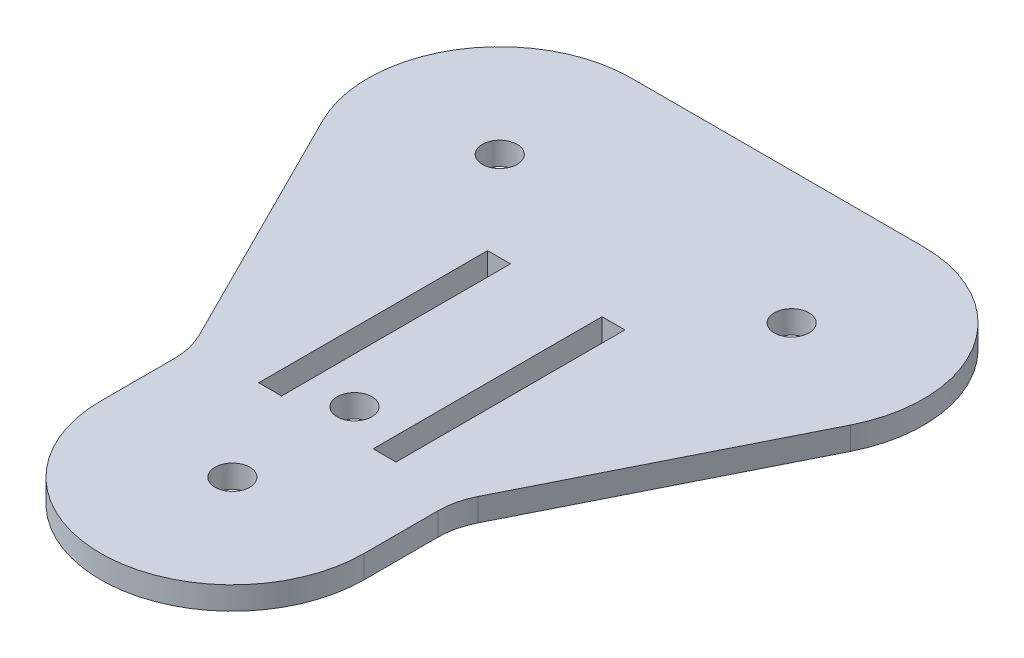
ISO-10303-21;
HEADER;
FILE_DESCRIPTION(('STEP AP214'),'2;1');
FILE_NAME('part.step','',(''),(''),'','','');
FILE_SCHEMA(('AUTOMOTIVE_DESIGN { 1 0 10303 214 1 1 1 1 }'));
ENDSEC;
DATA;
#1=APPLICATION_CONTEXT('core data for automotive mechanical design processes');
#2=APPLICATION_PROTOCOL_DEFINITION('international standard','automotive_design',2000,#1);
#3=PRODUCT_CONTEXT('',#1,'mechanical');
#4=PRODUCT('Part','Part','',(#3));
#5=PRODUCT_RELATED_PRODUCT_CATEGORY('part','',(#4));
#6=PRODUCT_DEFINITION_FORMATION('','',#4);
#7=PRODUCT_DEFINITION_CONTEXT('part definition',#1,'design');
#8=PRODUCT_DEFINITION('design','',#6,#7);
#9=PRODUCT_DEFINITION_SHAPE('','',#8);
#10=(LENGTH_UNIT() NAMED_UNIT(*) SI_UNIT(.MILLI.,.METRE.));
#11=(NAMED_UNIT(*) PLANE_ANGLE_UNIT() SI_UNIT($,.RADIAN.));
#12=(NAMED_UNIT(*) SI_UNIT($,.STERADIAN.) SOLID_ANGLE_UNIT());
#13=UNCERTAINTY_MEASURE_WITH_UNIT(LENGTH_MEASURE(1.E-05),#10,'distance_accuracy_value','');
#14=(GEOMETRIC_REPRESENTATION_CONTEXT(3) GLOBAL_UNCERTAINTY_ASSIGNED_CONTEXT((#13)) GLOBAL_UNIT_ASSIGNED_CONTEXT((#10,
#11,#12)) REPRESENTATION_CONTEXT('',''));
#15=CARTESIAN_POINT('',(0.,0.,0.));
#16=DIRECTION('',(0.,0.,1.));
#17=DIRECTION('',(1.,0.,0.));
#18=AXIS2_PLACEMENT_3D('',#15,#16,#17);
#19=CARTESIAN_POINT('',(0.,3.175,0.));
#20=DIRECTION('',(0.,1.,0.));
#21=DIRECTION('',(0.,0.,1.));
#22=AXIS2_PLACEMENT_3D('',#19,#20,#21);
#23=PLANE('',#22);
#24=DIRECTION('',(0.,0.,1.));
#25=VECTOR('',#24,1.);
#26=CARTESIAN_POINT('',(18.288,3.175,0.));
#27=LINE('',#26,#25);
#28=CARTESIAN_POINT('',(18.288,3.175,6.69138381866599));
#29=VERTEX_POINT('',#28);
#30=CARTESIAN_POINT('',(18.288,3.175,16.9333333333333));
#31=VERTEX_POINT('',#30);
#32=EDGE_CURVE('E256',#29,#31,#27,.T.);
#33=ORIENTED_EDGE('',*,*,#32,.F.);
#34=CARTESIAN_POINT('',(28.288,3.175,6.69138381866599));
#35=DIRECTION('',(0.,1.,0.));
#36=DIRECTION('',(0.,0.,1.));
#37=AXIS2_PLACEMENT_3D('',#34,#35,#36);
#38=CIRCLE('',#37,10.);
#39=CARTESIAN_POINT('',(19.3477723666203,3.175,2.21116843730827));
#40=VERTEX_POINT('',#39);
#41=EDGE_CURVE('E381',#29,#40,#38,.F.);
#42=ORIENTED_EDGE('',*,*,#41,.T.);
#43=DIRECTION('',(0.448021538135772,0.,-0.894022763337969));
#44=VECTOR('',#43,1.);
#45=CARTESIAN_POINT('',(16.3498882959248,3.175,8.19341788942701));
#46=LINE('',#45,#44);
#47=CARTESIAN_POINT('',(36.5936882959248,3.175,-32.202894510573));
#48=VERTEX_POINT('',#47);
#49=EDGE_CURVE('E259',#40,#48,#46,.T.);
#50=ORIENTED_EDGE('',*,*,#49,.T.);
#51=CARTESIAN_POINT('',(20.2438,3.175,-40.3963124));
#52=DIRECTION('',(0.,1.,0.));
#53=DIRECTION('',(0.,0.,1.));
#54=AXIS2_PLACEMENT_3D('',#51,#52,#53);
#55=CIRCLE('',#54,18.288);
#56=CARTESIAN_POINT('',(20.2438,3.175,-58.6843124));
#57=VERTEX_POINT('',#56);
#58=EDGE_CURVE('E263',#48,#57,#55,.T.);
#59=ORIENTED_EDGE('',*,*,#58,.T.);
#60=DIRECTION('',(1.,0.,0.));
#61=VECTOR('',#60,1.);
#62=CARTESIAN_POINT('',(0.,3.175,-58.6843124));
#63=LINE('',#62,#61);
#64=CARTESIAN_POINT('',(-20.2438,3.175,-58.6843124));
#65=VERTEX_POINT('',#64);
#66=EDGE_CURVE('E266',#65,#57,#63,.T.);
#67=ORIENTED_EDGE('',*,*,#66,.F.);
#68=CARTESIAN_POINT('',(-20.2438,3.175,-40.3963124));
#69=DIRECTION('',(0.,1.,0.));
#70=DIRECTION('',(0.,0.,1.));
#71=AXIS2_PLACEMENT_3D('',#68,#69,#70);
#72=CIRCLE('',#71,18.288);
#73=CARTESIAN_POINT('',(-36.5936882959248,3.175,-32.202894510573));
#74=VERTEX_POINT('',#73);
#75=EDGE_CURVE('E270',#65,#74,#72,.T.);
#76=ORIENTED_EDGE('',*,*,#75,.T.);
#77=DIRECTION('',(0.448021538135772,0.,0.894022763337969));
#78=VECTOR('',#77,1.);
#79=CARTESIAN_POINT('',(-16.3498882959248,3.175,8.193417889427));
#80=LINE('',#79,#78);
#81=CARTESIAN_POINT('',(-19.3477723666203,3.175,2.21116843730828));
#82=VERTEX_POINT('',#81);
#83=EDGE_CURVE('E273',#74,#82,#80,.T.);
#84=ORIENTED_EDGE('',*,*,#83,.T.);
#85=CARTESIAN_POINT('',(-28.288,3.175,6.69138381866599));
#86=DIRECTION('',(0.,1.,0.));
#87=DIRECTION('',(0.,0.,1.));
#88=AXIS2_PLACEMENT_3D('',#85,#86,#87);
#89=CIRCLE('',#88,10.);
#90=CARTESIAN_POINT('',(-18.288,3.175,6.69138381866599));
#91=VERTEX_POINT('',#90);
#92=EDGE_CURVE('E11',#82,#91,#89,.F.);
#93=ORIENTED_EDGE('',*,*,#92,.T.);
#94=DIRECTION('',(0.,0.,1.));
#95=VECTOR('',#94,1.);
#96=CARTESIAN_POINT('',(-18.288,3.175,0.));
#97=LINE('',#96,#95);
#98=CARTESIAN_POINT('',(-18.288,3.175,16.9333333333333));
#99=VERTEX_POINT('',#98);
#100=EDGE_CURVE('E277',#91,#99,#97,.T.);
#101=ORIENTED_EDGE('',*,*,#100,.T.);
#102=CARTESIAN_POINT('',(0.,3.175,16.9333333333333));
#103=DIRECTION('',(0.,1.,0.));
#104=DIRECTION('',(0.,0.,1.));
#105=AXIS2_PLACEMENT_3D('',#102,#103,#104);
#106=CIRCLE('',#105,18.288);
#107=EDGE_CURVE('E280',#99,#31,#106,.T.);
#108=ORIENTED_EDGE('',*,*,#107,.T.);
#109=EDGE_LOOP('',(#33,#42,#50,#59,#67,#76,#84,#93,#101,#108));
#110=FACE_BOUND('',#109,.T.);
#111=CARTESIAN_POINT('',(0.,3.175,16.9333333333333));
#112=DIRECTION('',(0.,1.,0.));
#113=DIRECTION('',(0.,0.,1.));
#114=AXIS2_PLACEMENT_3D('',#111,#112,#113);
#115=CIRCLE('',#114,2.413);
#116=CARTESIAN_POINT('',(0.,3.175,19.3463333333333));
#117=VERTEX_POINT('',#116);
#118=EDGE_CURVE('E284',#117,#117,#115,.T.);
#119=ORIENTED_EDGE('',*,*,#118,.F.);
#120=EDGE_LOOP('',(#119));
#121=FACE_BOUND('',#120,.T.);
#122=CARTESIAN_POINT('',(0.,3.175,0.));
#123=DIRECTION('',(0.,1.,0.));
#124=DIRECTION('',(0.,0.,1.));
#125=AXIS2_PLACEMENT_3D('',#122,#123,#124);
#126=CIRCLE('',#125,2.413);
#127=CARTESIAN_POINT('',(0.,3.175,2.413));
#128=VERTEX_POINT('',#127);
#129=EDGE_CURVE('E288',#128,#128,#126,.T.);
#130=ORIENTED_EDGE('',*,*,#129,.F.);
#131=EDGE_LOOP('',(#130));
#132=FACE_BOUND('',#131,.T.);
#133=CARTESIAN_POINT('',(-20.2438,3.175,-40.3963124));
#134=DIRECTION('',(0.,1.,0.));
#135=DIRECTION('',(0.,0.,1.));
#136=AXIS2_PLACEMENT_3D('',#133,#134,#135);
#137=CIRCLE('',#136,2.41300000000001);
#138=CARTESIAN_POINT('',(-20.2438,3.175,-37.9833124));
#139=VERTEX_POINT('',#138);
#140=EDGE_CURVE('E292',#139,#139,#137,.T.);
#141=ORIENTED_EDGE('',*,*,#140,.F.);
#142=EDGE_LOOP('',(#141));
#143=FACE_BOUND('',#142,.T.);
#144=CARTESIAN_POINT('',(20.2438,3.175,-40.3963124));
#145=DIRECTION('',(0.,1.,0.));
#146=DIRECTION('',(0.,0.,1.));
#147=AXIS2_PLACEMENT_3D('',#144,#145,#146);
#148=CIRCLE('',#147,2.413);
#149=CARTESIAN_POINT('',(20.2438,3.175,-37.9833124));
#150=VERTEX_POINT('',#149);
#151=EDGE_CURVE('E296',#150,#150,#148,.T.);
#152=ORIENTED_EDGE('',*,*,#151,.F.);
#153=EDGE_LOOP('',(#152));
#154=FACE_BOUND('',#153,.T.);
#155=DIRECTION('',(-1.,0.,0.));
#156=VECTOR('',#155,1.);
#157=CARTESIAN_POINT('',(0.,3.175,-27.9884886));
#158=LINE('',#157,#156);
#159=CARTESIAN_POINT('',(9.525,3.175,-27.9884886));
#160=VERTEX_POINT('',#159);
#161=CARTESIAN_POINT('',(6.35,3.175,-27.9884886));
#162=VERTEX_POINT('',#161);
#163=EDGE_CURVE('E228',#160,#162,#158,.T.);
#164=ORIENTED_EDGE('',*,*,#163,.F.);
#165=DIRECTION('',(0.,0.,1.));
#166=VECTOR('',#165,1.);
#167=CARTESIAN_POINT('',(9.525,3.175,0.));
#168=LINE('',#167,#166);
#169=CARTESIAN_POINT('',(9.525,3.175,3.76151139999999));
#170=VERTEX_POINT('',#169);
#171=EDGE_CURVE('E65',#160,#170,#168,.T.);
#172=ORIENTED_EDGE('',*,*,#171,.T.);
#173=DIRECTION('',(-1.,0.,0.));
#174=VECTOR('',#173,1.);
#175=CARTESIAN_POINT('',(0.,3.175,3.76151139999999));
#176=LINE('',#175,#174);
#177=CARTESIAN_POINT('',(6.35,3.175,3.76151139999999));
#178=VERTEX_POINT('',#177);
#179=EDGE_CURVE('E236',#170,#178,#176,.T.);
#180=ORIENTED_EDGE('',*,*,#179,.T.);
#181=DIRECTION('',(0.,0.,1.));
#182=VECTOR('',#181,1.);
#183=CARTESIAN_POINT('',(6.35,3.175,0.));
#184=LINE('',#183,#182);
#185=EDGE_CURVE('E232',#162,#178,#184,.T.);
#186=ORIENTED_EDGE('',*,*,#185,.F.);
#187=EDGE_LOOP('',(#164,#172,#180,#186));
#188=FACE_BOUND('',#187,.T.);
#189=DIRECTION('',(1.,0.,0.));
#190=VECTOR('',#189,1.);
#191=CARTESIAN_POINT('',(0.,3.175,-27.9884886));
#192=LINE('',#191,#190);
#193=CARTESIAN_POINT('',(-9.525,3.175,-27.9884886));
#194=VERTEX_POINT('',#193);
#195=CARTESIAN_POINT('',(-6.35,3.175,-27.9884886));
#196=VERTEX_POINT('',#195);
#197=EDGE_CURVE('E193',#194,#196,#192,.T.);
#198=ORIENTED_EDGE('',*,*,#197,.T.);
#199=DIRECTION('',(0.,0.,1.));
#200=VECTOR('',#199,1.);
#201=CARTESIAN_POINT('',(-6.35,3.175,0.));
#202=LINE('',#201,#200);
#203=CARTESIAN_POINT('',(-6.35,3.175,3.76151139999999));
#204=VERTEX_POINT('',#203);
#205=EDGE_CURVE('E57',#196,#204,#202,.T.);
#206=ORIENTED_EDGE('',*,*,#205,.T.);
#207=DIRECTION('',(1.,0.,0.));
#208=VECTOR('',#207,1.);
#209=CARTESIAN_POINT('',(0.,3.175,3.76151139999999));
#210=LINE('',#209,#208);
#211=CARTESIAN_POINT('',(-9.525,3.175,3.76151139999999));
#212=VERTEX_POINT('',#211);
#213=EDGE_CURVE('E184',#212,#204,#210,.T.);
#214=ORIENTED_EDGE('',*,*,#213,.F.);
#215=DIRECTION('',(0.,0.,1.));
#216=VECTOR('',#215,1.);
#217=CARTESIAN_POINT('',(-9.525,3.175,0.));
#218=LINE('',#217,#216);
#219=EDGE_CURVE('E201',#194,#212,#218,.T.);
#220=ORIENTED_EDGE('',*,*,#219,.F.);
#221=EDGE_LOOP('',(#198,#206,#214,#220));
#222=FACE_BOUND('',#221,.T.);
#223=ADVANCED_FACE('F41',(#110,#121,#132,#143,#154,#188,#222),#23,.T.);
#224=CARTESIAN_POINT('',(0.,0.,0.));
#225=DIRECTION('',(0.,1.,0.));
#226=DIRECTION('',(0.,0.,1.));
#227=AXIS2_PLACEMENT_3D('',#224,#225,#226);
#228=PLANE('',#227);
#229=DIRECTION('',(0.,0.,-1.));
#230=VECTOR('',#229,1.);
#231=CARTESIAN_POINT('',(9.525,0.,0.));
#232=LINE('',#231,#230);
#233=CARTESIAN_POINT('',(9.525,0.,3.76151139999999));
#234=VERTEX_POINT('',#233);
#235=CARTESIAN_POINT('',(9.525,0.,-27.9884886));
#236=VERTEX_POINT('',#235);
#237=EDGE_CURVE('E222',#234,#236,#232,.T.);
#238=ORIENTED_EDGE('',*,*,#237,.T.);
#239=DIRECTION('',(1.,0.,0.));
#240=VECTOR('',#239,1.);
#241=CARTESIAN_POINT('',(0.,0.,-27.9884886));
#242=LINE('',#241,#240);
#243=CARTESIAN_POINT('',(6.35,0.,-27.9884886));
#244=VERTEX_POINT('',#243);
#245=EDGE_CURVE('E244',#244,#236,#242,.T.);
#246=ORIENTED_EDGE('',*,*,#245,.F.);
#247=DIRECTION('',(0.,0.,-1.));
#248=VECTOR('',#247,1.);
#249=CARTESIAN_POINT('',(6.35,0.,0.));
#250=LINE('',#249,#248);
#251=CARTESIAN_POINT('',(6.35,0.,3.76151139999999));
#252=VERTEX_POINT('',#251);
#253=EDGE_CURVE('E215',#252,#244,#250,.T.);
#254=ORIENTED_EDGE('',*,*,#253,.F.);
#255=DIRECTION('',(1.,0.,0.));
#256=VECTOR('',#255,1.);
#257=CARTESIAN_POINT('',(0.,0.,3.76151139999999));
#258=LINE('',#257,#256);
#259=EDGE_CURVE('E218',#252,#234,#258,.T.);
#260=ORIENTED_EDGE('',*,*,#259,.T.);
#261=EDGE_LOOP('',(#238,#246,#254,#260));
#262=FACE_BOUND('',#261,.T.);
#263=DIRECTION('',(0.448021538135772,0.,-0.894022763337969));
#264=VECTOR('',#263,1.);
#265=CARTESIAN_POINT('',(16.3498882959248,0.,8.19341788942701));
#266=LINE('',#265,#264);
#267=CARTESIAN_POINT('',(19.3477723666203,0.,2.21116843730827));
#268=VERTEX_POINT('',#267);
#269=CARTESIAN_POINT('',(36.5936882959248,0.,-32.202894510573));
#270=VERTEX_POINT('',#269);
#271=EDGE_CURVE('E303',#268,#270,#266,.T.);
#272=ORIENTED_EDGE('',*,*,#271,.F.);
#273=CARTESIAN_POINT('',(28.288,0.,6.69138381866599));
#274=DIRECTION('',(0.,1.,0.));
#275=DIRECTION('',(0.,0.,1.));
#276=AXIS2_PLACEMENT_3D('',#273,#274,#275);
#277=CIRCLE('',#276,10.);
#278=CARTESIAN_POINT('',(18.288,0.,6.69138381866599));
#279=VERTEX_POINT('',#278);
#280=EDGE_CURVE('E378',#268,#279,#277,.T.);
#281=ORIENTED_EDGE('',*,*,#280,.T.);
#282=DIRECTION('',(0.,0.,1.));
#283=VECTOR('',#282,1.);
#284=CARTESIAN_POINT('',(18.288,0.,0.));
#285=LINE('',#284,#283);
#286=CARTESIAN_POINT('',(18.288,0.,16.9333333333333));
#287=VERTEX_POINT('',#286);
#288=EDGE_CURVE('E177',#279,#287,#285,.T.);
#289=ORIENTED_EDGE('',*,*,#288,.T.);
#290=CARTESIAN_POINT('',(0.,0.,16.9333333333333));
#291=DIRECTION('',(0.,1.,0.));
#292=DIRECTION('',(0.,0.,1.));
#293=AXIS2_PLACEMENT_3D('',#290,#291,#292);
#294=CIRCLE('',#293,18.288);
#295=CARTESIAN_POINT('',(-18.288,0.,16.9333333333333));
#296=VERTEX_POINT('',#295);
#297=EDGE_CURVE('E324',#296,#287,#294,.T.);
#298=ORIENTED_EDGE('',*,*,#297,.F.);
#299=DIRECTION('',(0.,0.,1.));
#300=VECTOR('',#299,1.);
#301=CARTESIAN_POINT('',(-18.288,0.,0.));
#302=LINE('',#301,#300);
#303=CARTESIAN_POINT('',(-18.288,0.,6.69138381866599));
#304=VERTEX_POINT('',#303);
#305=EDGE_CURVE('E321',#304,#296,#302,.T.);
#306=ORIENTED_EDGE('',*,*,#305,.F.);
#307=CARTESIAN_POINT('',(-28.288,0.,6.69138381866599));
#308=DIRECTION('',(0.,1.,0.));
#309=DIRECTION('',(0.,0.,1.));
#310=AXIS2_PLACEMENT_3D('',#307,#308,#309);
#311=CIRCLE('',#310,10.);
#312=CARTESIAN_POINT('',(-19.3477723666203,0.,2.21116843730828));
#313=VERTEX_POINT('',#312);
#314=EDGE_CURVE('E50',#304,#313,#311,.T.);
#315=ORIENTED_EDGE('',*,*,#314,.T.);
#316=DIRECTION('',(0.448021538135772,0.,0.894022763337969));
#317=VECTOR('',#316,1.);
#318=CARTESIAN_POINT('',(-16.3498882959248,0.,8.193417889427));
#319=LINE('',#318,#317);
#320=CARTESIAN_POINT('',(-36.5936882959248,0.,-32.202894510573));
#321=VERTEX_POINT('',#320);
#322=EDGE_CURVE('E317',#321,#313,#319,.T.);
#323=ORIENTED_EDGE('',*,*,#322,.F.);
#324=CARTESIAN_POINT('',(-20.2438,0.,-40.3963124));
#325=DIRECTION('',(0.,1.,0.));
#326=DIRECTION('',(0.,0.,1.));
#327=AXIS2_PLACEMENT_3D('',#324,#325,#326);
#328=CIRCLE('',#327,18.288);
#329=CARTESIAN_POINT('',(-20.2438,0.,-58.6843124));
#330=VERTEX_POINT('',#329);
#331=EDGE_CURVE('E314',#330,#321,#328,.T.);
#332=ORIENTED_EDGE('',*,*,#331,.F.);
#333=DIRECTION('',(1.,0.,0.));
#334=VECTOR('',#333,1.);
#335=CARTESIAN_POINT('',(0.,0.,-58.6843124));
#336=LINE('',#335,#334);
#337=CARTESIAN_POINT('',(20.2438,0.,-58.6843124));
#338=VERTEX_POINT('',#337);
#339=EDGE_CURVE('E310',#330,#338,#336,.T.);
#340=ORIENTED_EDGE('',*,*,#339,.T.);
#341=CARTESIAN_POINT('',(20.2438,0.,-40.3963124));
#342=DIRECTION('',(0.,1.,0.));
#343=DIRECTION('',(0.,0.,1.));
#344=AXIS2_PLACEMENT_3D('',#341,#342,#343);
#345=CIRCLE('',#344,18.288);
#346=EDGE_CURVE('E306',#270,#338,#345,.T.);
#347=ORIENTED_EDGE('',*,*,#346,.F.);
#348=EDGE_LOOP('',(#272,#281,#289,#298,#306,#315,#323,#332,#340,#347));
#349=FACE_BOUND('',#348,.T.);
#350=CARTESIAN_POINT('',(0.,0.,16.9333333333333));
#351=DIRECTION('',(0.,1.,0.));
#352=DIRECTION('',(0.,0.,1.));
#353=AXIS2_PLACEMENT_3D('',#350,#351,#352);
#354=CIRCLE('',#353,2.413);
#355=CARTESIAN_POINT('',(0.,0.,19.3463333333333));
#356=VERTEX_POINT('',#355);
#357=EDGE_CURVE('E328',#356,#356,#354,.T.);
#358=ORIENTED_EDGE('',*,*,#357,.T.);
#359=EDGE_LOOP('',(#358));
#360=FACE_BOUND('',#359,.T.);
#361=CARTESIAN_POINT('',(0.,0.,0.));
#362=DIRECTION('',(0.,1.,0.));
#363=DIRECTION('',(0.,0.,1.));
#364=AXIS2_PLACEMENT_3D('',#361,#362,#363);
#365=CIRCLE('',#364,2.413);
#366=CARTESIAN_POINT('',(0.,0.,2.413));
#367=VERTEX_POINT('',#366);
#368=EDGE_CURVE('E332',#367,#367,#365,.T.);
#369=ORIENTED_EDGE('',*,*,#368,.T.);
#370=EDGE_LOOP('',(#369));
#371=FACE_BOUND('',#370,.T.);
#372=CARTESIAN_POINT('',(-20.2438,0.,-40.3963124));
#373=DIRECTION('',(0.,1.,0.));
#374=DIRECTION('',(0.,0.,1.));
#375=AXIS2_PLACEMENT_3D('',#372,#373,#374);
#376=CIRCLE('',#375,2.41300000000001);
#377=CARTESIAN_POINT('',(-20.2438,0.,-37.9833124));
#378=VERTEX_POINT('',#377);
#379=EDGE_CURVE('E336',#378,#378,#376,.T.);
#380=ORIENTED_EDGE('',*,*,#379,.T.);
#381=EDGE_LOOP('',(#380));
#382=FACE_BOUND('',#381,.T.);
#383=CARTESIAN_POINT('',(20.2438,0.,-40.3963124));
#384=DIRECTION('',(0.,1.,0.));
#385=DIRECTION('',(0.,0.,1.));
#386=AXIS2_PLACEMENT_3D('',#383,#384,#385);
#387=CIRCLE('',#386,2.413);
#388=CARTESIAN_POINT('',(20.2438,0.,-37.9833124));
#389=VERTEX_POINT('',#388);
#390=EDGE_CURVE('E260',#389,#389,#387,.T.);
#391=ORIENTED_EDGE('',*,*,#390,.T.);
#392=EDGE_LOOP('',(#391));
#393=FACE_BOUND('',#392,.T.);
#394=DIRECTION('',(0.,0.,-1.));
#395=VECTOR('',#394,1.);
#396=CARTESIAN_POINT('',(-6.35,0.,0.));
#397=LINE('',#396,#395);
#398=CARTESIAN_POINT('',(-6.35,0.,3.76151139999999));
#399=VERTEX_POINT('',#398);
#400=CARTESIAN_POINT('',(-6.35,0.,-27.9884886));
#401=VERTEX_POINT('',#400);
#402=EDGE_CURVE('E181',#399,#401,#397,.T.);
#403=ORIENTED_EDGE('',*,*,#402,.T.);
#404=DIRECTION('',(-1.,0.,0.));
#405=VECTOR('',#404,1.);
#406=CARTESIAN_POINT('',(0.,0.,-27.9884886));
#407=LINE('',#406,#405);
#408=CARTESIAN_POINT('',(-9.525,0.,-27.9884886));
#409=VERTEX_POINT('',#408);
#410=EDGE_CURVE('E166',#401,#409,#407,.T.);
#411=ORIENTED_EDGE('',*,*,#410,.T.);
#412=DIRECTION('',(0.,0.,-1.));
#413=VECTOR('',#412,1.);
#414=CARTESIAN_POINT('',(-9.525,0.,0.));
#415=LINE('',#414,#413);
#416=CARTESIAN_POINT('',(-9.525,0.,3.76151139999999));
#417=VERTEX_POINT('',#416);
#418=EDGE_CURVE('E195',#417,#409,#415,.T.);
#419=ORIENTED_EDGE('',*,*,#418,.F.);
#420=DIRECTION('',(-1.,0.,0.));
#421=VECTOR('',#420,1.);
#422=CARTESIAN_POINT('',(0.,0.,3.76151139999999));
#423=LINE('',#422,#421);
#424=EDGE_CURVE('E188',#399,#417,#423,.T.);
#425=ORIENTED_EDGE('',*,*,#424,.F.);
#426=EDGE_LOOP('',(#403,#411,#419,#425));
#427=FACE_BOUND('',#426,.T.);
#428=ADVANCED_FACE('F187',(#262,#349,#360,#371,#382,#393,#427),#228,.F.);
#429=CARTESIAN_POINT('',(18.288,3.175,0.));
#430=DIRECTION('',(1.,0.,0.));
#431=DIRECTION('',(0.,0.,-1.));
#432=AXIS2_PLACEMENT_3D('',#429,#430,#431);
#433=PLANE('',#432);
#434=ORIENTED_EDGE('',*,*,#288,.F.);
#435=DIRECTION('',(0.,-1.,0.));
#436=VECTOR('',#435,1.);
#437=CARTESIAN_POINT('',(18.288,3.175,6.69138381866599));
#438=LINE('',#437,#436);
#439=EDGE_CURVE('E368',#279,#29,#438,.F.);
#440=ORIENTED_EDGE('',*,*,#439,.T.);
#441=ORIENTED_EDGE('',*,*,#32,.T.);
#442=DIRECTION('',(0.,-1.,0.));
#443=VECTOR('',#442,1.);
#444=CARTESIAN_POINT('',(18.288,3.175,16.9333333333333));
#445=LINE('',#444,#443);
#446=EDGE_CURVE('E300',#31,#287,#445,.T.);
#447=ORIENTED_EDGE('',*,*,#446,.T.);
#448=EDGE_LOOP('',(#434,#440,#441,#447));
#449=FACE_BOUND('',#448,.T.);
#450=ADVANCED_FACE('F446',(#449),#433,.T.);
#451=CARTESIAN_POINT('',(16.3498882959248,3.175,8.19341788942701));
#452=DIRECTION('',(-0.894022763337968,0.,-0.448021538135772));
#453=DIRECTION('',(-0.448021538135772,0.,0.894022763337969));
#454=AXIS2_PLACEMENT_3D('',#451,#452,#453);
#455=PLANE('',#454);
#456=ORIENTED_EDGE('',*,*,#49,.F.);
#457=DIRECTION('',(0.,-1.,0.));
#458=VECTOR('',#457,1.);
#459=CARTESIAN_POINT('',(19.3477723666203,3.175,2.21116843730828));
#460=LINE('',#459,#458);
#461=EDGE_CURVE('E364',#40,#268,#460,.T.);
#462=ORIENTED_EDGE('',*,*,#461,.T.);
#463=ORIENTED_EDGE('',*,*,#271,.T.);
#464=DIRECTION('',(0.,-1.,0.));
#465=VECTOR('',#464,1.);
#466=CARTESIAN_POINT('',(36.5936882959248,3.175,-32.202894510573));
#467=LINE('',#466,#465);
#468=EDGE_CURVE('E360',#48,#270,#467,.T.);
#469=ORIENTED_EDGE('',*,*,#468,.F.);
#470=EDGE_LOOP('',(#456,#462,#463,#469));
#471=FACE_BOUND('',#470,.T.);
#472=ADVANCED_FACE('F418',(#471),#455,.F.);
#473=CARTESIAN_POINT('',(20.2438,3.175,-40.3963124));
#474=DIRECTION('',(0.,-1.,0.));
#475=DIRECTION('',(0.,0.,-1.));
#476=AXIS2_PLACEMENT_3D('',#473,#474,#475);
#477=CYLINDRICAL_SURFACE('',#476,18.288);
#478=ORIENTED_EDGE('',*,*,#346,.T.);
#479=DIRECTION('',(0.,-1.,0.));
#480=VECTOR('',#479,1.);
#481=CARTESIAN_POINT('',(20.2438,3.175,-58.6843124));
#482=LINE('',#481,#480);
#483=EDGE_CURVE('E357',#57,#338,#482,.T.);
#484=ORIENTED_EDGE('',*,*,#483,.F.);
#485=ORIENTED_EDGE('',*,*,#58,.F.);
#486=ORIENTED_EDGE('',*,*,#468,.T.);
#487=EDGE_LOOP('',(#478,#484,#485,#486));
#488=FACE_BOUND('',#487,.T.);
#489=ADVANCED_FACE('F425',(#488),#477,.T.);
#490=CARTESIAN_POINT('',(0.,3.175,-58.6843124));
#491=DIRECTION('',(0.,0.,-1.));
#492=DIRECTION('',(-1.,0.,0.));
#493=AXIS2_PLACEMENT_3D('',#490,#491,#492);
#494=PLANE('',#493);
#495=ORIENTED_EDGE('',*,*,#339,.F.);
#496=DIRECTION('',(0.,-1.,0.));
#497=VECTOR('',#496,1.);
#498=CARTESIAN_POINT('',(-20.2438,3.175,-58.6843124));
#499=LINE('',#498,#497);
#500=EDGE_CURVE('E354',#65,#330,#499,.T.);
#501=ORIENTED_EDGE('',*,*,#500,.F.);
#502=ORIENTED_EDGE('',*,*,#66,.T.);
#503=ORIENTED_EDGE('',*,*,#483,.T.);
#504=EDGE_LOOP('',(#495,#501,#502,#503));
#505=FACE_BOUND('',#504,.T.);
#506=ADVANCED_FACE('F430',(#505),#494,.T.);
#507=CARTESIAN_POINT('',(-20.2438,3.175,-40.3963124));
#508=DIRECTION('',(0.,-1.,0.));
#509=DIRECTION('',(0.,0.,-1.));
#510=AXIS2_PLACEMENT_3D('',#507,#508,#509);
#511=CYLINDRICAL_SURFACE('',#510,18.288);
#512=ORIENTED_EDGE('',*,*,#331,.T.);
#513=DIRECTION('',(0.,-1.,0.));
#514=VECTOR('',#513,1.);
#515=CARTESIAN_POINT('',(-36.5936882959248,3.175,-32.202894510573));
#516=LINE('',#515,#514);
#517=EDGE_CURVE('E350',#74,#321,#516,.T.);
#518=ORIENTED_EDGE('',*,*,#517,.F.);
#519=ORIENTED_EDGE('',*,*,#75,.F.);
#520=ORIENTED_EDGE('',*,*,#500,.T.);
#521=EDGE_LOOP('',(#512,#518,#519,#520));
#522=FACE_BOUND('',#521,.T.);
#523=ADVANCED_FACE('F432',(#522),#511,.T.);
#524=CARTESIAN_POINT('',(-16.3498882959248,3.175,8.193417889427));
#525=DIRECTION('',(0.894022763337969,0.,-0.448021538135772));
#526=DIRECTION('',(-0.448021538135772,0.,-0.894022763337969));
#527=AXIS2_PLACEMENT_3D('',#524,#525,#526);
#528=PLANE('',#527);
#529=ORIENTED_EDGE('',*,*,#322,.T.);
#530=DIRECTION('',(0.,-1.,0.));
#531=VECTOR('',#530,1.);
#532=CARTESIAN_POINT('',(-19.3477723666203,3.175,2.21116843730828));
#533=LINE('',#532,#531);
#534=EDGE_CURVE('E375',#313,#82,#533,.F.);
#535=ORIENTED_EDGE('',*,*,#534,.T.);
#536=ORIENTED_EDGE('',*,*,#83,.F.);
#537=ORIENTED_EDGE('',*,*,#517,.T.);
#538=EDGE_LOOP('',(#529,#535,#536,#537));
#539=FACE_BOUND('',#538,.T.);
#540=ADVANCED_FACE('F395',(#539),#528,.F.);
#541=CARTESIAN_POINT('',(-18.288,3.175,0.));
#542=DIRECTION('',(1.,0.,0.));
#543=DIRECTION('',(0.,0.,-1.));
#544=AXIS2_PLACEMENT_3D('',#541,#542,#543);
#545=PLANE('',#544);
#546=ORIENTED_EDGE('',*,*,#100,.F.);
#547=DIRECTION('',(0.,-1.,0.));
#548=VECTOR('',#547,1.);
#549=CARTESIAN_POINT('',(-18.288,0.,6.69138381866599));
#550=LINE('',#549,#548);
#551=EDGE_CURVE('E371',#91,#304,#550,.T.);
#552=ORIENTED_EDGE('',*,*,#551,.T.);
#553=ORIENTED_EDGE('',*,*,#305,.T.);
#554=DIRECTION('',(0.,-1.,0.));
#555=VECTOR('',#554,1.);
#556=CARTESIAN_POINT('',(-18.288,3.175,16.9333333333333));
#557=LINE('',#556,#555);
#558=EDGE_CURVE('E346',#99,#296,#557,.T.);
#559=ORIENTED_EDGE('',*,*,#558,.F.);
#560=EDGE_LOOP('',(#546,#552,#553,#559));
#561=FACE_BOUND('',#560,.T.);
#562=ADVANCED_FACE('F405',(#561),#545,.F.);
#563=CARTESIAN_POINT('',(-20.2438,3.175,-40.3963124));
#564=DIRECTION('',(0.,-1.,0.));
#565=DIRECTION('',(0.,0.,-1.));
#566=AXIS2_PLACEMENT_3D('',#563,#564,#565);
#567=CYLINDRICAL_SURFACE('',#566,2.41300000000001);
#568=ORIENTED_EDGE('',*,*,#140,.T.);
#569=EDGE_LOOP('',(#568));
#570=FACE_BOUND('',#569,.T.);
#571=ORIENTED_EDGE('',*,*,#379,.F.);
#572=EDGE_LOOP('',(#571));
#573=FACE_BOUND('',#572,.T.);
#574=ADVANCED_FACE('F457',(#570,#573),#567,.F.);
#575=CARTESIAN_POINT('',(0.,3.175,0.));
#576=DIRECTION('',(0.,-1.,0.));
#577=DIRECTION('',(0.,0.,-1.));
#578=AXIS2_PLACEMENT_3D('',#575,#576,#577);
#579=CYLINDRICAL_SURFACE('',#578,2.413);
#580=ORIENTED_EDGE('',*,*,#129,.T.);
#581=EDGE_LOOP('',(#580));
#582=FACE_BOUND('',#581,.T.);
#583=ORIENTED_EDGE('',*,*,#368,.F.);
#584=EDGE_LOOP('',(#583));
#585=FACE_BOUND('',#584,.T.);
#586=ADVANCED_FACE('F460',(#582,#585),#579,.F.);
#587=CARTESIAN_POINT('',(0.,3.175,16.9333333333333));
#588=DIRECTION('',(0.,-1.,0.));
#589=DIRECTION('',(0.,0.,-1.));
#590=AXIS2_PLACEMENT_3D('',#587,#588,#589);
#591=CYLINDRICAL_SURFACE('',#590,2.413);
#592=ORIENTED_EDGE('',*,*,#118,.T.);
#593=EDGE_LOOP('',(#592));
#594=FACE_BOUND('',#593,.T.);
#595=ORIENTED_EDGE('',*,*,#357,.F.);
#596=EDGE_LOOP('',(#595));
#597=FACE_BOUND('',#596,.T.);
#598=ADVANCED_FACE('F464',(#594,#597),#591,.F.);
#599=CARTESIAN_POINT('',(0.,3.175,16.9333333333333));
#600=DIRECTION('',(0.,-1.,0.));
#601=DIRECTION('',(0.,0.,-1.));
#602=AXIS2_PLACEMENT_3D('',#599,#600,#601);
#603=CYLINDRICAL_SURFACE('',#602,18.288);
#604=ORIENTED_EDGE('',*,*,#297,.T.);
#605=ORIENTED_EDGE('',*,*,#446,.F.);
#606=ORIENTED_EDGE('',*,*,#107,.F.);
#607=ORIENTED_EDGE('',*,*,#558,.T.);
#608=EDGE_LOOP('',(#604,#605,#606,#607));
#609=FACE_BOUND('',#608,.T.);
#610=ADVANCED_FACE('F409',(#609),#603,.T.);
#611=CARTESIAN_POINT('',(20.2438,3.175,-40.3963124));
#612=DIRECTION('',(0.,-1.,0.));
#613=DIRECTION('',(0.,0.,-1.));
#614=AXIS2_PLACEMENT_3D('',#611,#612,#613);
#615=CYLINDRICAL_SURFACE('',#614,2.413);
#616=ORIENTED_EDGE('',*,*,#151,.T.);
#617=EDGE_LOOP('',(#616));
#618=FACE_BOUND('',#617,.T.);
#619=ORIENTED_EDGE('',*,*,#390,.F.);
#620=EDGE_LOOP('',(#619));
#621=FACE_BOUND('',#620,.T.);
#622=ADVANCED_FACE('F453',(#618,#621),#615,.F.);
#623=CARTESIAN_POINT('',(28.288,3.175,6.69138381866599));
#624=DIRECTION('',(0.,-1.,0.));
#625=DIRECTION('',(0.,0.,-1.));
#626=AXIS2_PLACEMENT_3D('',#623,#624,#625);
#627=CYLINDRICAL_SURFACE('',#626,10.);
#628=ORIENTED_EDGE('',*,*,#41,.F.);
#629=ORIENTED_EDGE('',*,*,#439,.F.);
#630=ORIENTED_EDGE('',*,*,#280,.F.);
#631=ORIENTED_EDGE('',*,*,#461,.F.);
#632=EDGE_LOOP('',(#628,#629,#630,#631));
#633=FACE_BOUND('',#632,.T.);
#634=ADVANCED_FACE('F416',(#633),#627,.F.);
#635=CARTESIAN_POINT('',(-28.288,3.175,6.69138381866599));
#636=DIRECTION('',(0.,1.,0.));
#637=DIRECTION('',(0.,0.,1.));
#638=AXIS2_PLACEMENT_3D('',#635,#636,#637);
#639=CYLINDRICAL_SURFACE('',#638,10.);
#640=ORIENTED_EDGE('',*,*,#92,.F.);
#641=ORIENTED_EDGE('',*,*,#534,.F.);
#642=ORIENTED_EDGE('',*,*,#314,.F.);
#643=ORIENTED_EDGE('',*,*,#551,.F.);
#644=EDGE_LOOP('',(#640,#641,#642,#643));
#645=FACE_BOUND('',#644,.T.);
#646=ADVANCED_FACE('F43',(#645),#639,.F.);
#647=CARTESIAN_POINT('',(9.525,-0.00100000000000013,0.));
#648=DIRECTION('',(-1.,0.,0.));
#649=DIRECTION('',(0.,0.,1.));
#650=AXIS2_PLACEMENT_3D('',#647,#648,#649);
#651=PLANE('',#650);
#652=DIRECTION('',(0.,1.,0.));
#653=VECTOR('',#652,1.);
#654=CARTESIAN_POINT('',(9.525,-0.00100000000000013,3.76151139999999));
#655=LINE('',#654,#653);
#656=EDGE_CURVE('E241',#234,#170,#655,.T.);
#657=ORIENTED_EDGE('',*,*,#656,.T.);
#658=ORIENTED_EDGE('',*,*,#171,.F.);
#659=DIRECTION('',(0.,1.,0.));
#660=VECTOR('',#659,1.);
#661=CARTESIAN_POINT('',(9.525,-0.00100000000000013,-27.9884886));
#662=LINE('',#661,#660);
#663=EDGE_CURVE('E240',#236,#160,#662,.T.);
#664=ORIENTED_EDGE('',*,*,#663,.F.);
#665=ORIENTED_EDGE('',*,*,#237,.F.);
#666=EDGE_LOOP('',(#657,#658,#664,#665));
#667=FACE_BOUND('',#666,.T.);
#668=ADVANCED_FACE('F450',(#667),#651,.T.);
#669=CARTESIAN_POINT('',(0.,-0.00100000000000013,3.76151139999999));
#670=DIRECTION('',(0.,0.,-1.));
#671=DIRECTION('',(-1.,0.,0.));
#672=AXIS2_PLACEMENT_3D('',#669,#670,#671);
#673=PLANE('',#672);
#674=DIRECTION('',(0.,1.,0.));
#675=VECTOR('',#674,1.);
#676=CARTESIAN_POINT('',(6.35,-0.00100000000000013,3.76151139999999));
#677=LINE('',#676,#675);
#678=EDGE_CURVE('E245',#252,#178,#677,.T.);
#679=ORIENTED_EDGE('',*,*,#678,.T.);
#680=ORIENTED_EDGE('',*,*,#179,.F.);
#681=ORIENTED_EDGE('',*,*,#656,.F.);
#682=ORIENTED_EDGE('',*,*,#259,.F.);
#683=EDGE_LOOP('',(#679,#680,#681,#682));
#684=FACE_BOUND('',#683,.T.);
#685=ADVANCED_FACE('F513',(#684),#673,.T.);
#686=CARTESIAN_POINT('',(6.35,-0.00100000000000013,0.));
#687=DIRECTION('',(-1.,0.,0.));
#688=DIRECTION('',(0.,0.,1.));
#689=AXIS2_PLACEMENT_3D('',#686,#687,#688);
#690=PLANE('',#689);
#691=ORIENTED_EDGE('',*,*,#253,.T.);
#692=DIRECTION('',(0.,1.,0.));
#693=VECTOR('',#692,1.);
#694=CARTESIAN_POINT('',(6.35,-0.00100000000000013,-27.9884886));
#695=LINE('',#694,#693);
#696=EDGE_CURVE('E248',#244,#162,#695,.T.);
#697=ORIENTED_EDGE('',*,*,#696,.T.);
#698=ORIENTED_EDGE('',*,*,#185,.T.);
#699=ORIENTED_EDGE('',*,*,#678,.F.);
#700=EDGE_LOOP('',(#691,#697,#698,#699));
#701=FACE_BOUND('',#700,.T.);
#702=ADVANCED_FACE('F520',(#701),#690,.F.);
#703=CARTESIAN_POINT('',(0.,-0.00100000000000013,-27.9884886));
#704=DIRECTION('',(0.,0.,-1.));
#705=DIRECTION('',(-1.,0.,0.));
#706=AXIS2_PLACEMENT_3D('',#703,#704,#705);
#707=PLANE('',#706);
#708=ORIENTED_EDGE('',*,*,#245,.T.);
#709=ORIENTED_EDGE('',*,*,#663,.T.);
#710=ORIENTED_EDGE('',*,*,#163,.T.);
#711=ORIENTED_EDGE('',*,*,#696,.F.);
#712=EDGE_LOOP('',(#708,#709,#710,#711));
#713=FACE_BOUND('',#712,.T.);
#714=ADVANCED_FACE('F528',(#713),#707,.F.);
#715=CARTESIAN_POINT('',(-6.35,-0.00100000000000013,0.));
#716=DIRECTION('',(-1.,0.,0.));
#717=DIRECTION('',(0.,0.,1.));
#718=AXIS2_PLACEMENT_3D('',#715,#716,#717);
#719=PLANE('',#718);
#720=DIRECTION('',(0.,1.,0.));
#721=VECTOR('',#720,1.);
#722=CARTESIAN_POINT('',(-6.35,-0.00100000000000013,3.76151139999999));
#723=LINE('',#722,#721);
#724=EDGE_CURVE('E178',#399,#204,#723,.T.);
#725=ORIENTED_EDGE('',*,*,#724,.T.);
#726=ORIENTED_EDGE('',*,*,#205,.F.);
#727=DIRECTION('',(0.,1.,0.));
#728=VECTOR('',#727,1.);
#729=CARTESIAN_POINT('',(-6.35,-0.00100000000000013,-27.9884886));
#730=LINE('',#729,#728);
#731=EDGE_CURVE('E169',#401,#196,#730,.T.);
#732=ORIENTED_EDGE('',*,*,#731,.F.);
#733=ORIENTED_EDGE('',*,*,#402,.F.);
#734=EDGE_LOOP('',(#725,#726,#732,#733));
#735=FACE_BOUND('',#734,.T.);
#736=ADVANCED_FACE('F180',(#735),#719,.T.);
#737=CARTESIAN_POINT('',(0.,-0.00100000000000013,3.76151139999999));
#738=DIRECTION('',(0.,0.,1.));
#739=DIRECTION('',(1.,0.,0.));
#740=AXIS2_PLACEMENT_3D('',#737,#738,#739);
#741=PLANE('',#740);
#742=ORIENTED_EDGE('',*,*,#424,.T.);
#743=DIRECTION('',(0.,1.,0.));
#744=VECTOR('',#743,1.);
#745=CARTESIAN_POINT('',(-9.525,-0.00100000000000013,3.76151139999999));
#746=LINE('',#745,#744);
#747=EDGE_CURVE('E210',#417,#212,#746,.T.);
#748=ORIENTED_EDGE('',*,*,#747,.T.);
#749=ORIENTED_EDGE('',*,*,#213,.T.);
#750=ORIENTED_EDGE('',*,*,#724,.F.);
#751=EDGE_LOOP('',(#742,#748,#749,#750));
#752=FACE_BOUND('',#751,.T.);
#753=ADVANCED_FACE('F542',(#752),#741,.F.);
#754=CARTESIAN_POINT('',(-9.525,-0.00100000000000013,0.));
#755=DIRECTION('',(-1.,0.,0.));
#756=DIRECTION('',(0.,0.,1.));
#757=AXIS2_PLACEMENT_3D('',#754,#755,#756);
#758=PLANE('',#757);
#759=ORIENTED_EDGE('',*,*,#418,.T.);
#760=DIRECTION('',(0.,1.,0.));
#761=VECTOR('',#760,1.);
#762=CARTESIAN_POINT('',(-9.525,-0.00100000000000013,-27.9884886));
#763=LINE('',#762,#761);
#764=EDGE_CURVE('E171',#409,#194,#763,.T.);
#765=ORIENTED_EDGE('',*,*,#764,.T.);
#766=ORIENTED_EDGE('',*,*,#219,.T.);
#767=ORIENTED_EDGE('',*,*,#747,.F.);
#768=EDGE_LOOP('',(#759,#765,#766,#767));
#769=FACE_BOUND('',#768,.T.);
#770=ADVANCED_FACE('F549',(#769),#758,.F.);
#771=CARTESIAN_POINT('',(0.,-0.00100000000000013,-27.9884886));
#772=DIRECTION('',(0.,0.,1.));
#773=DIRECTION('',(1.,0.,0.));
#774=AXIS2_PLACEMENT_3D('',#771,#772,#773);
#775=PLANE('',#774);
#776=ORIENTED_EDGE('',*,*,#731,.T.);
#777=ORIENTED_EDGE('',*,*,#197,.F.);
#778=ORIENTED_EDGE('',*,*,#764,.F.);
#779=ORIENTED_EDGE('',*,*,#410,.F.);
#780=EDGE_LOOP('',(#776,#777,#778,#779));
#781=FACE_BOUND('',#780,.T.);
#782=ADVANCED_FACE('F167',(#781),#775,.T.);
#783=CLOSED_SHELL('',(#223,#428,#450,#472,#489,#506,#523,#540,#562,#574,#586,#598,#610,#622,
#634,#646,#668,#685,#702,#714,#736,#753,#770,#782));
#784=MANIFOLD_SOLID_BREP('B2',#783);
#785=ADVANCED_BREP_SHAPE_REPRESENTATION('',(#18,#784),#14);
#786=SHAPE_DEFINITION_REPRESENTATION(#9,#785);
ENDSEC;
END-ISO-10303-21;
